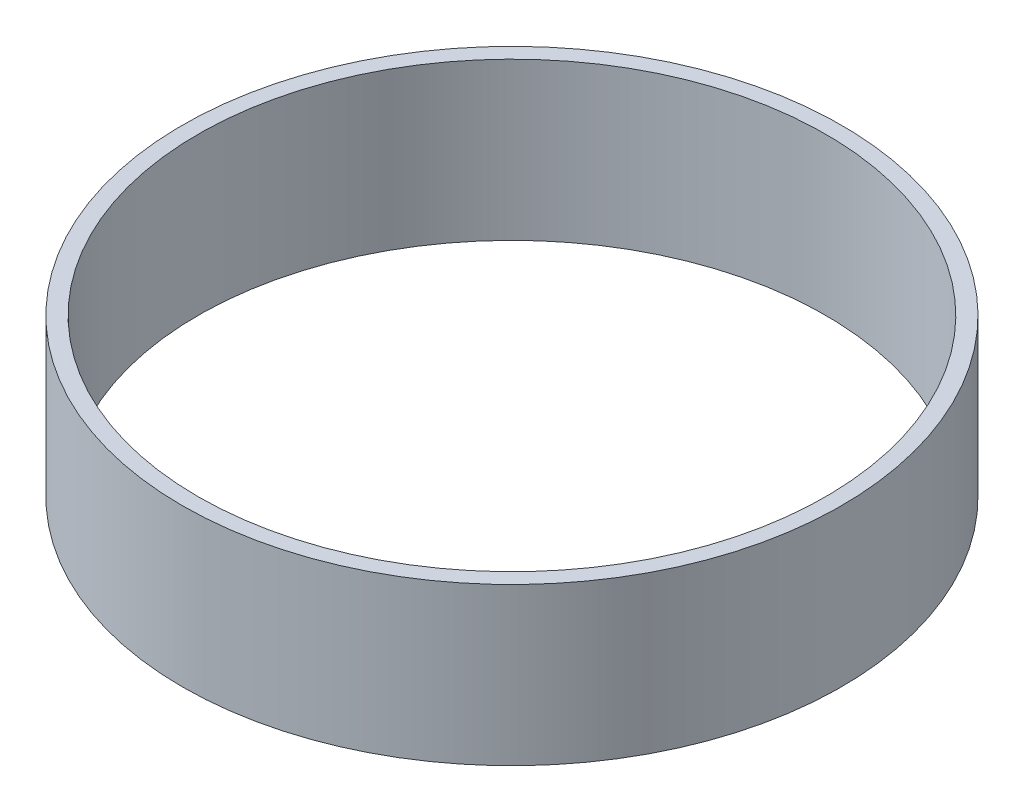
ISO-10303-21;
HEADER;
FILE_DESCRIPTION(('STEP AP214'),'2;1');
FILE_NAME('part.step','',(''),(''),'','','');
FILE_SCHEMA(('AUTOMOTIVE_DESIGN { 1 0 10303 214 1 1 1 1 }'));
ENDSEC;
DATA;
#1=APPLICATION_CONTEXT('core data for automotive mechanical design processes');
#2=APPLICATION_PROTOCOL_DEFINITION('international standard','automotive_design',2000,#1);
#3=PRODUCT_CONTEXT('',#1,'mechanical');
#4=PRODUCT('Part','Part','',(#3));
#5=PRODUCT_RELATED_PRODUCT_CATEGORY('part','',(#4));
#6=PRODUCT_DEFINITION_FORMATION('','',#4);
#7=PRODUCT_DEFINITION_CONTEXT('part definition',#1,'design');
#8=PRODUCT_DEFINITION('design','',#6,#7);
#9=PRODUCT_DEFINITION_SHAPE('','',#8);
#10=(LENGTH_UNIT() NAMED_UNIT(*) SI_UNIT(.MILLI.,.METRE.));
#11=(NAMED_UNIT(*) PLANE_ANGLE_UNIT() SI_UNIT($,.RADIAN.));
#12=(NAMED_UNIT(*) SI_UNIT($,.STERADIAN.) SOLID_ANGLE_UNIT());
#13=UNCERTAINTY_MEASURE_WITH_UNIT(LENGTH_MEASURE(1.E-05),#10,'distance_accuracy_value','');
#14=(GEOMETRIC_REPRESENTATION_CONTEXT(3) GLOBAL_UNCERTAINTY_ASSIGNED_CONTEXT((#13)) GLOBAL_UNIT_ASSIGNED_CONTEXT((#10,
#11,#12)) REPRESENTATION_CONTEXT('',''));
#15=CARTESIAN_POINT('',(0.,0.,0.));
#16=DIRECTION('',(0.,0.,1.));
#17=DIRECTION('',(1.,0.,0.));
#18=AXIS2_PLACEMENT_3D('',#15,#16,#17);
#19=CARTESIAN_POINT('',(0.,10.,0.));
#20=DIRECTION('',(0.,1.,0.));
#21=DIRECTION('',(0.,0.,1.));
#22=AXIS2_PLACEMENT_3D('',#19,#20,#21);
#23=PLANE('',#22);
#24=CARTESIAN_POINT('',(0.,10.,0.));
#25=DIRECTION('',(0.,1.,0.));
#26=DIRECTION('',(0.,0.,1.));
#27=AXIS2_PLACEMENT_3D('',#24,#25,#26);
#28=CIRCLE('',#27,21.);
#29=CARTESIAN_POINT('',(0.,10.,21.));
#30=VERTEX_POINT('',#29);
#31=EDGE_CURVE('E10',#30,#30,#28,.T.);
#32=ORIENTED_EDGE('',*,*,#31,.T.);
#33=EDGE_LOOP('',(#32));
#34=FACE_BOUND('',#33,.T.);
#35=CARTESIAN_POINT('',(0.,10.,0.));
#36=DIRECTION('',(0.,1.,0.));
#37=DIRECTION('',(0.,0.,1.));
#38=AXIS2_PLACEMENT_3D('',#35,#36,#37);
#39=CIRCLE('',#38,20.);
#40=CARTESIAN_POINT('',(0.,10.,20.));
#41=VERTEX_POINT('',#40);
#42=EDGE_CURVE('E42',#41,#41,#39,.T.);
#43=ORIENTED_EDGE('',*,*,#42,.F.);
#44=EDGE_LOOP('',(#43));
#45=FACE_BOUND('',#44,.T.);
#46=ADVANCED_FACE('F31',(#34,#45),#23,.T.);
#47=CARTESIAN_POINT('',(0.,0.,0.));
#48=DIRECTION('',(0.,1.,0.));
#49=DIRECTION('',(0.,0.,1.));
#50=AXIS2_PLACEMENT_3D('',#47,#48,#49);
#51=PLANE('',#50);
#52=CARTESIAN_POINT('',(0.,0.,0.));
#53=DIRECTION('',(0.,1.,0.));
#54=DIRECTION('',(0.,0.,1.));
#55=AXIS2_PLACEMENT_3D('',#52,#53,#54);
#56=CIRCLE('',#55,21.);
#57=CARTESIAN_POINT('',(0.,0.,21.));
#58=VERTEX_POINT('',#57);
#59=EDGE_CURVE('E35',#58,#58,#56,.T.);
#60=ORIENTED_EDGE('',*,*,#59,.F.);
#61=EDGE_LOOP('',(#60));
#62=FACE_BOUND('',#61,.T.);
#63=CARTESIAN_POINT('',(0.,0.,0.));
#64=DIRECTION('',(0.,1.,0.));
#65=DIRECTION('',(0.,0.,1.));
#66=AXIS2_PLACEMENT_3D('',#63,#64,#65);
#67=CIRCLE('',#66,20.);
#68=CARTESIAN_POINT('',(0.,0.,20.));
#69=VERTEX_POINT('',#68);
#70=EDGE_CURVE('E44',#69,#69,#67,.T.);
#71=ORIENTED_EDGE('',*,*,#70,.T.);
#72=EDGE_LOOP('',(#71));
#73=FACE_BOUND('',#72,.T.);
#74=ADVANCED_FACE('F54',(#62,#73),#51,.F.);
#75=CARTESIAN_POINT('',(0.,10.,0.));
#76=DIRECTION('',(0.,-1.,0.));
#77=DIRECTION('',(0.,0.,-1.));
#78=AXIS2_PLACEMENT_3D('',#75,#76,#77);
#79=CYLINDRICAL_SURFACE('',#78,21.);
#80=ORIENTED_EDGE('',*,*,#31,.F.);
#81=EDGE_LOOP('',(#80));
#82=FACE_BOUND('',#81,.T.);
#83=ORIENTED_EDGE('',*,*,#59,.T.);
#84=EDGE_LOOP('',(#83));
#85=FACE_BOUND('',#84,.T.);
#86=ADVANCED_FACE('F33',(#82,#85),#79,.T.);
#87=CARTESIAN_POINT('',(0.,10.,0.));
#88=DIRECTION('',(0.,-1.,0.));
#89=DIRECTION('',(0.,0.,-1.));
#90=AXIS2_PLACEMENT_3D('',#87,#88,#89);
#91=CYLINDRICAL_SURFACE('',#90,20.);
#92=ORIENTED_EDGE('',*,*,#42,.T.);
#93=EDGE_LOOP('',(#92));
#94=FACE_BOUND('',#93,.T.);
#95=ORIENTED_EDGE('',*,*,#70,.F.);
#96=EDGE_LOOP('',(#95));
#97=FACE_BOUND('',#96,.T.);
#98=ADVANCED_FACE('F50',(#94,#97),#91,.F.);
#99=CLOSED_SHELL('',(#46,#74,#86,#98));
#100=MANIFOLD_SOLID_BREP('B2',#99);
#101=ADVANCED_BREP_SHAPE_REPRESENTATION('',(#18,#100),#14);
#102=SHAPE_DEFINITION_REPRESENTATION(#9,#101);
ENDSEC;
END-ISO-10303-21;
